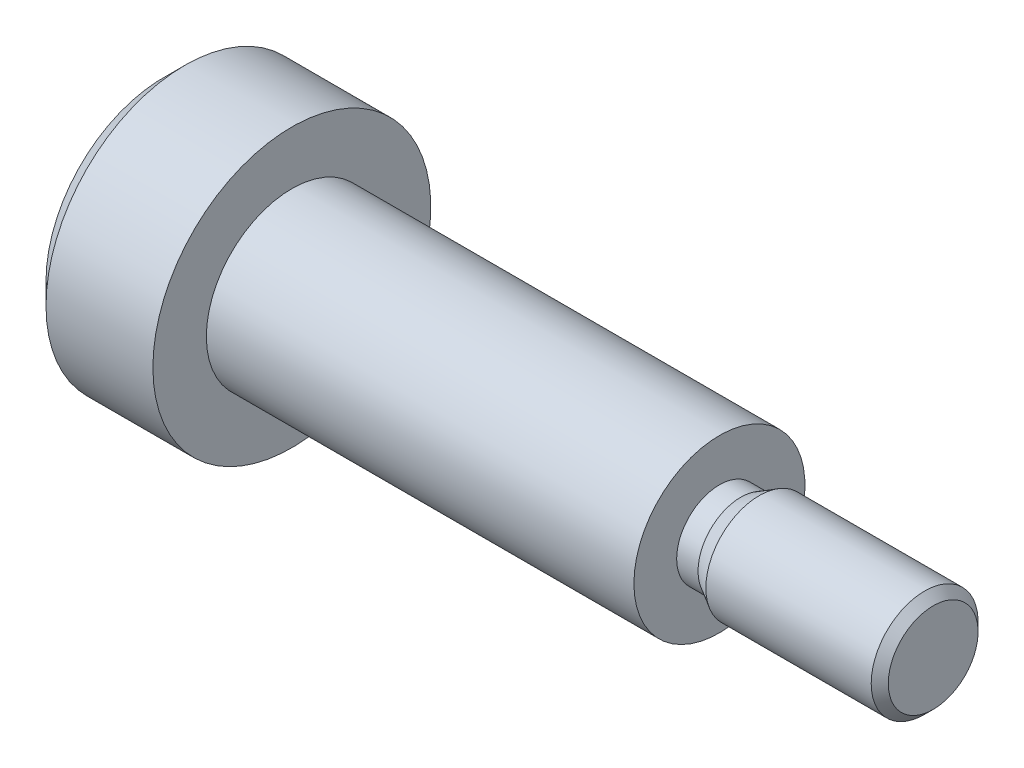
ISO-10303-21;
HEADER;
FILE_DESCRIPTION(('STEP AP214'),'2;1');
FILE_NAME('part.step','',(''),(''),'','','');
FILE_SCHEMA(('AUTOMOTIVE_DESIGN { 1 0 10303 214 1 1 1 1 }'));
ENDSEC;
DATA;
#1=APPLICATION_CONTEXT('core data for automotive mechanical design processes');
#2=APPLICATION_PROTOCOL_DEFINITION('international standard','automotive_design',2000,#1);
#3=PRODUCT_CONTEXT('',#1,'mechanical');
#4=PRODUCT('Part','Part','',(#3));
#5=PRODUCT_RELATED_PRODUCT_CATEGORY('part','',(#4));
#6=PRODUCT_DEFINITION_FORMATION('','',#4);
#7=PRODUCT_DEFINITION_CONTEXT('part definition',#1,'design');
#8=PRODUCT_DEFINITION('design','',#6,#7);
#9=PRODUCT_DEFINITION_SHAPE('','',#8);
#10=(LENGTH_UNIT() NAMED_UNIT(*) SI_UNIT(.MILLI.,.METRE.));
#11=(NAMED_UNIT(*) PLANE_ANGLE_UNIT() SI_UNIT($,.RADIAN.));
#12=(NAMED_UNIT(*) SI_UNIT($,.STERADIAN.) SOLID_ANGLE_UNIT());
#13=UNCERTAINTY_MEASURE_WITH_UNIT(LENGTH_MEASURE(1.E-05),#10,'distance_accuracy_value','');
#14=(GEOMETRIC_REPRESENTATION_CONTEXT(3) GLOBAL_UNCERTAINTY_ASSIGNED_CONTEXT((#13)) GLOBAL_UNIT_ASSIGNED_CONTEXT((#10,
#11,#12)) REPRESENTATION_CONTEXT('',''));
#15=CARTESIAN_POINT('',(0.,0.,0.));
#16=DIRECTION('',(0.,0.,1.));
#17=DIRECTION('',(1.,0.,0.));
#18=AXIS2_PLACEMENT_3D('',#15,#16,#17);
#19=CARTESIAN_POINT('',(0.,0.,0.));
#20=DIRECTION('',(1.,0.,0.));
#21=DIRECTION('',(0.,0.,-1.));
#22=AXIS2_PLACEMENT_3D('',#19,#20,#21);
#23=PLANE('',#22);
#24=CARTESIAN_POINT('',(0.,0.,0.));
#25=DIRECTION('',(1.,0.,0.));
#26=DIRECTION('',(0.,0.,-1.));
#27=AXIS2_PLACEMENT_3D('',#24,#25,#26);
#28=CIRCLE('',#27,2.75);
#29=CARTESIAN_POINT('',(0.,0.,-2.75));
#30=VERTEX_POINT('',#29);
#31=EDGE_CURVE('E47',#30,#30,#28,.F.);
#32=ORIENTED_EDGE('',*,*,#31,.T.);
#33=EDGE_LOOP('',(#32));
#34=FACE_BOUND('',#33,.T.);
#35=ADVANCED_FACE('F32',(#34),#23,.F.);
#36=CARTESIAN_POINT('',(0.,0.,0.));
#37=DIRECTION('',(-1.,0.,0.));
#38=DIRECTION('',(0.,0.,1.));
#39=AXIS2_PLACEMENT_3D('',#36,#37,#38);
#40=CYLINDRICAL_SURFACE('',#39,3.25);
#41=CARTESIAN_POINT('',(0.500000000000003,0.,0.));
#42=DIRECTION('',(1.,0.,0.));
#43=DIRECTION('',(0.,0.,-1.));
#44=AXIS2_PLACEMENT_3D('',#41,#42,#43);
#45=CIRCLE('',#44,3.25);
#46=CARTESIAN_POINT('',(0.500000000000003,0.,-3.25));
#47=VERTEX_POINT('',#46);
#48=EDGE_CURVE('E43',#47,#47,#45,.T.);
#49=ORIENTED_EDGE('',*,*,#48,.T.);
#50=EDGE_LOOP('',(#49));
#51=FACE_BOUND('',#50,.T.);
#52=CARTESIAN_POINT('',(3.,0.,0.));
#53=DIRECTION('',(-1.,0.,0.));
#54=DIRECTION('',(0.,0.,1.));
#55=AXIS2_PLACEMENT_3D('',#52,#53,#54);
#56=CIRCLE('',#55,3.25);
#57=CARTESIAN_POINT('',(3.,0.,3.25));
#58=VERTEX_POINT('',#57);
#59=EDGE_CURVE('E52',#58,#58,#56,.T.);
#60=ORIENTED_EDGE('',*,*,#59,.T.);
#61=EDGE_LOOP('',(#60));
#62=FACE_BOUND('',#61,.T.);
#63=ADVANCED_FACE('F85',(#51,#62),#40,.T.);
#64=CARTESIAN_POINT('',(3.,3.25,0.));
#65=DIRECTION('',(-1.,0.,0.));
#66=DIRECTION('',(0.,0.,1.));
#67=AXIS2_PLACEMENT_3D('',#64,#65,#66);
#68=PLANE('',#67);
#69=ORIENTED_EDGE('',*,*,#59,.F.);
#70=EDGE_LOOP('',(#69));
#71=FACE_BOUND('',#70,.T.);
#72=CARTESIAN_POINT('',(3.,0.,0.));
#73=DIRECTION('',(-1.,0.,0.));
#74=DIRECTION('',(0.,0.,1.));
#75=AXIS2_PLACEMENT_3D('',#72,#73,#74);
#76=CIRCLE('',#75,2.);
#77=CARTESIAN_POINT('',(3.,0.,2.));
#78=VERTEX_POINT('',#77);
#79=EDGE_CURVE('E55',#78,#78,#76,.T.);
#80=ORIENTED_EDGE('',*,*,#79,.T.);
#81=EDGE_LOOP('',(#80));
#82=FACE_BOUND('',#81,.T.);
#83=ADVANCED_FACE('F91',(#71,#82),#68,.F.);
#84=CARTESIAN_POINT('',(0.,0.,0.));
#85=DIRECTION('',(-1.,0.,0.));
#86=DIRECTION('',(0.,0.,1.));
#87=AXIS2_PLACEMENT_3D('',#84,#85,#86);
#88=CYLINDRICAL_SURFACE('',#87,2.);
#89=ORIENTED_EDGE('',*,*,#79,.F.);
#90=EDGE_LOOP('',(#89));
#91=FACE_BOUND('',#90,.T.);
#92=CARTESIAN_POINT('',(13.,0.,0.));
#93=DIRECTION('',(-1.,0.,0.));
#94=DIRECTION('',(0.,0.,1.));
#95=AXIS2_PLACEMENT_3D('',#92,#93,#94);
#96=CIRCLE('',#95,2.);
#97=CARTESIAN_POINT('',(13.,0.,2.));
#98=VERTEX_POINT('',#97);
#99=EDGE_CURVE('E58',#98,#98,#96,.T.);
#100=ORIENTED_EDGE('',*,*,#99,.T.);
#101=EDGE_LOOP('',(#100));
#102=FACE_BOUND('',#101,.T.);
#103=ADVANCED_FACE('F106',(#91,#102),#88,.T.);
#104=CARTESIAN_POINT('',(13.,2.,0.));
#105=DIRECTION('',(-1.,0.,0.));
#106=DIRECTION('',(0.,0.,1.));
#107=AXIS2_PLACEMENT_3D('',#104,#105,#106);
#108=PLANE('',#107);
#109=ORIENTED_EDGE('',*,*,#99,.F.);
#110=EDGE_LOOP('',(#109));
#111=FACE_BOUND('',#110,.T.);
#112=CARTESIAN_POINT('',(13.,0.,0.));
#113=DIRECTION('',(-1.,0.,0.));
#114=DIRECTION('',(0.,0.,1.));
#115=AXIS2_PLACEMENT_3D('',#112,#113,#114);
#116=CIRCLE('',#115,1.);
#117=CARTESIAN_POINT('',(13.,0.,1.));
#118=VERTEX_POINT('',#117);
#119=EDGE_CURVE('E61',#118,#118,#116,.T.);
#120=ORIENTED_EDGE('',*,*,#119,.T.);
#121=EDGE_LOOP('',(#120));
#122=FACE_BOUND('',#121,.T.);
#123=ADVANCED_FACE('F98',(#111,#122),#108,.F.);
#124=CARTESIAN_POINT('',(0.,0.,0.));
#125=DIRECTION('',(1.,0.,0.));
#126=DIRECTION('',(0.,0.,-1.));
#127=AXIS2_PLACEMENT_3D('',#124,#125,#126);
#128=CONICAL_SURFACE('',#127,2.75,0.785398163397444);
#129=ORIENTED_EDGE('',*,*,#48,.F.);
#130=EDGE_LOOP('',(#129));
#131=FACE_BOUND('',#130,.T.);
#132=ORIENTED_EDGE('',*,*,#31,.F.);
#133=EDGE_LOOP('',(#132));
#134=FACE_BOUND('',#133,.T.);
#135=ADVANCED_FACE('F95',(#131,#134),#128,.T.);
#136=CARTESIAN_POINT('',(0.,0.,0.));
#137=DIRECTION('',(-1.,0.,0.));
#138=DIRECTION('',(0.,0.,1.));
#139=AXIS2_PLACEMENT_3D('',#136,#137,#138);
#140=CYLINDRICAL_SURFACE('',#139,1.);
#141=CARTESIAN_POINT('',(13.5,0.,0.));
#142=DIRECTION('',(-1.,0.,0.));
#143=DIRECTION('',(0.,0.,1.));
#144=AXIS2_PLACEMENT_3D('',#141,#142,#143);
#145=CIRCLE('',#144,1.);
#146=CARTESIAN_POINT('',(13.5,0.,1.));
#147=VERTEX_POINT('',#146);
#148=EDGE_CURVE('E64',#147,#147,#145,.T.);
#149=ORIENTED_EDGE('',*,*,#148,.T.);
#150=EDGE_LOOP('',(#149));
#151=FACE_BOUND('',#150,.T.);
#152=ORIENTED_EDGE('',*,*,#119,.F.);
#153=EDGE_LOOP('',(#152));
#154=FACE_BOUND('',#153,.T.);
#155=ADVANCED_FACE('F97',(#151,#154),#140,.T.);
#156=CARTESIAN_POINT('',(13.5,0.,0.));
#157=DIRECTION('',(1.,0.,0.));
#158=DIRECTION('',(0.,0.,-1.));
#159=AXIS2_PLACEMENT_3D('',#156,#157,#158);
#160=CONICAL_SURFACE('',#159,1.,0.5235987755983);
#161=CARTESIAN_POINT('',(13.9330127018922,0.,0.));
#162=DIRECTION('',(-1.,0.,0.));
#163=DIRECTION('',(0.,0.,1.));
#164=AXIS2_PLACEMENT_3D('',#161,#162,#163);
#165=CIRCLE('',#164,1.25);
#166=CARTESIAN_POINT('',(13.9330127018922,0.,1.25));
#167=VERTEX_POINT('',#166);
#168=EDGE_CURVE('E67',#167,#167,#165,.T.);
#169=ORIENTED_EDGE('',*,*,#168,.T.);
#170=EDGE_LOOP('',(#169));
#171=FACE_BOUND('',#170,.T.);
#172=ORIENTED_EDGE('',*,*,#148,.F.);
#173=EDGE_LOOP('',(#172));
#174=FACE_BOUND('',#173,.T.);
#175=ADVANCED_FACE('F71',(#171,#174),#160,.T.);
#176=CARTESIAN_POINT('',(18.,1.25,0.));
#177=DIRECTION('',(-1.,0.,0.));
#178=DIRECTION('',(0.,0.,1.));
#179=AXIS2_PLACEMENT_3D('',#176,#177,#178);
#180=PLANE('',#179);
#181=CARTESIAN_POINT('',(18.,0.,0.));
#182=DIRECTION('',(-1.,0.,0.));
#183=DIRECTION('',(0.,0.,1.));
#184=AXIS2_PLACEMENT_3D('',#181,#182,#183);
#185=CIRCLE('',#184,1.05);
#186=CARTESIAN_POINT('',(18.,0.,1.05));
#187=VERTEX_POINT('',#186);
#188=EDGE_CURVE('E10',#187,#187,#185,.F.);
#189=ORIENTED_EDGE('',*,*,#188,.T.);
#190=EDGE_LOOP('',(#189));
#191=FACE_BOUND('',#190,.T.);
#192=ADVANCED_FACE('F80',(#191),#180,.F.);
#193=CARTESIAN_POINT('',(17.8,0.,0.));
#194=DIRECTION('',(-1.,0.,0.));
#195=DIRECTION('',(0.,0.,1.));
#196=AXIS2_PLACEMENT_3D('',#193,#194,#195);
#197=CONICAL_SURFACE('',#196,1.25,0.785398163397437);
#198=ORIENTED_EDGE('',*,*,#188,.F.);
#199=EDGE_LOOP('',(#198));
#200=FACE_BOUND('',#199,.T.);
#201=CARTESIAN_POINT('',(17.8,0.,0.));
#202=DIRECTION('',(-1.,0.,0.));
#203=DIRECTION('',(0.,0.,1.));
#204=AXIS2_PLACEMENT_3D('',#201,#202,#203);
#205=CIRCLE('',#204,1.25);
#206=CARTESIAN_POINT('',(17.8,0.,1.25));
#207=VERTEX_POINT('',#206);
#208=EDGE_CURVE('E39',#207,#207,#205,.T.);
#209=ORIENTED_EDGE('',*,*,#208,.F.);
#210=EDGE_LOOP('',(#209));
#211=FACE_BOUND('',#210,.T.);
#212=ADVANCED_FACE('F34',(#200,#211),#197,.T.);
#213=CARTESIAN_POINT('',(0.,0.,0.));
#214=DIRECTION('',(-1.,0.,0.));
#215=DIRECTION('',(0.,0.,1.));
#216=AXIS2_PLACEMENT_3D('',#213,#214,#215);
#217=CYLINDRICAL_SURFACE('',#216,1.25);
#218=ORIENTED_EDGE('',*,*,#208,.T.);
#219=EDGE_LOOP('',(#218));
#220=FACE_BOUND('',#219,.T.);
#221=ORIENTED_EDGE('',*,*,#168,.F.);
#222=EDGE_LOOP('',(#221));
#223=FACE_BOUND('',#222,.T.);
#224=ADVANCED_FACE('F74',(#220,#223),#217,.T.);
#225=CLOSED_SHELL('',(#35,#63,#83,#103,#123,#135,#155,#175,#192,#212,#224));
#226=MANIFOLD_SOLID_BREP('B2',#225);
#227=ADVANCED_BREP_SHAPE_REPRESENTATION('',(#18,#226),#14);
#228=SHAPE_DEFINITION_REPRESENTATION(#9,#227);
ENDSEC;
END-ISO-10303-21;
